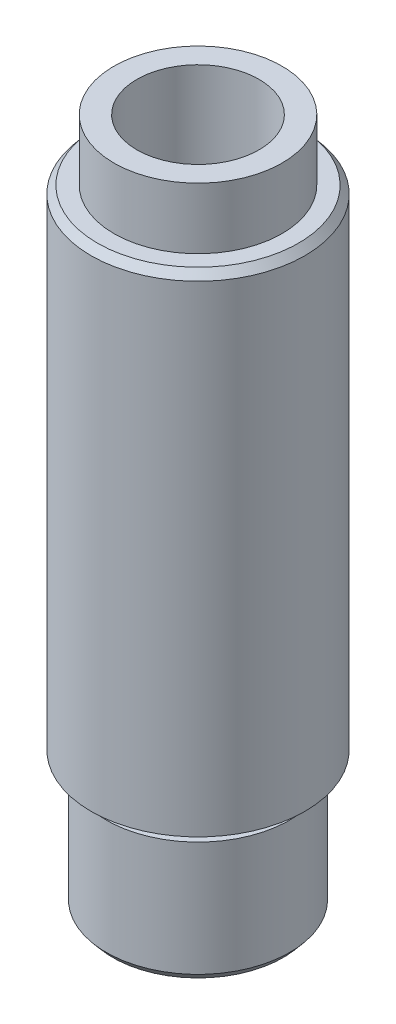
ISO-10303-21;
HEADER;
FILE_DESCRIPTION(('STEP AP214'),'2;1');
FILE_NAME('part.step','',(''),(''),'','','');
FILE_SCHEMA(('AUTOMOTIVE_DESIGN { 1 0 10303 214 1 1 1 1 }'));
ENDSEC;
DATA;
#1=APPLICATION_CONTEXT('core data for automotive mechanical design processes');
#2=APPLICATION_PROTOCOL_DEFINITION('international standard','automotive_design',2000,#1);
#3=PRODUCT_CONTEXT('',#1,'mechanical');
#4=PRODUCT('Part','Part','',(#3));
#5=PRODUCT_RELATED_PRODUCT_CATEGORY('part','',(#4));
#6=PRODUCT_DEFINITION_FORMATION('','',#4);
#7=PRODUCT_DEFINITION_CONTEXT('part definition',#1,'design');
#8=PRODUCT_DEFINITION('design','',#6,#7);
#9=PRODUCT_DEFINITION_SHAPE('','',#8);
#10=(LENGTH_UNIT() NAMED_UNIT(*) SI_UNIT(.MILLI.,.METRE.));
#11=(NAMED_UNIT(*) PLANE_ANGLE_UNIT() SI_UNIT($,.RADIAN.));
#12=(NAMED_UNIT(*) SI_UNIT($,.STERADIAN.) SOLID_ANGLE_UNIT());
#13=UNCERTAINTY_MEASURE_WITH_UNIT(LENGTH_MEASURE(1.E-05),#10,'distance_accuracy_value','');
#14=(GEOMETRIC_REPRESENTATION_CONTEXT(3) GLOBAL_UNCERTAINTY_ASSIGNED_CONTEXT((#13)) GLOBAL_UNIT_ASSIGNED_CONTEXT((#10,
#11,#12)) REPRESENTATION_CONTEXT('',''));
#15=CARTESIAN_POINT('',(0.,0.,0.));
#16=DIRECTION('',(0.,0.,1.));
#17=DIRECTION('',(1.,0.,0.));
#18=AXIS2_PLACEMENT_3D('',#15,#16,#17);
#19=CARTESIAN_POINT('',(0.,32.,0.));
#20=DIRECTION('',(0.,1.,0.));
#21=DIRECTION('',(0.,0.,1.));
#22=AXIS2_PLACEMENT_3D('',#19,#20,#21);
#23=PLANE('',#22);
#24=CARTESIAN_POINT('',(0.,32.,0.));
#25=DIRECTION('',(0.,1.,0.));
#26=DIRECTION('',(0.,0.,1.));
#27=AXIS2_PLACEMENT_3D('',#24,#25,#26);
#28=CIRCLE('',#27,6.58045018441136);
#29=CARTESIAN_POINT('',(0.,32.,6.58045018441136));
#30=VERTEX_POINT('',#29);
#31=EDGE_CURVE('E52',#30,#30,#28,.T.);
#32=ORIENTED_EDGE('',*,*,#31,.T.);
#33=EDGE_LOOP('',(#32));
#34=FACE_BOUND('',#33,.T.);
#35=CARTESIAN_POINT('',(0.,32.,0.));
#36=DIRECTION('',(0.,1.,0.));
#37=DIRECTION('',(0.,0.,1.));
#38=AXIS2_PLACEMENT_3D('',#35,#36,#37);
#39=CIRCLE('',#38,5.5);
#40=CARTESIAN_POINT('',(0.,32.,5.5));
#41=VERTEX_POINT('',#40);
#42=EDGE_CURVE('E90',#41,#41,#39,.T.);
#43=ORIENTED_EDGE('',*,*,#42,.F.);
#44=EDGE_LOOP('',(#43));
#45=FACE_BOUND('',#44,.T.);
#46=ADVANCED_FACE('F45',(#34,#45),#23,.T.);
#47=CARTESIAN_POINT('',(0.,0.,0.));
#48=DIRECTION('',(0.,1.,0.));
#49=DIRECTION('',(0.,0.,1.));
#50=AXIS2_PLACEMENT_3D('',#47,#48,#49);
#51=PLANE('',#50);
#52=CARTESIAN_POINT('',(0.,0.,0.));
#53=DIRECTION('',(0.,1.,0.));
#54=DIRECTION('',(0.,0.,1.));
#55=AXIS2_PLACEMENT_3D('',#52,#53,#54);
#56=CIRCLE('',#55,5.5);
#57=CARTESIAN_POINT('',(0.,0.,5.5));
#58=VERTEX_POINT('',#57);
#59=EDGE_CURVE('E71',#58,#58,#56,.F.);
#60=ORIENTED_EDGE('',*,*,#59,.F.);
#61=EDGE_LOOP('',(#60));
#62=FACE_BOUND('',#61,.T.);
#63=CARTESIAN_POINT('',(0.,0.,0.));
#64=DIRECTION('',(0.,1.,0.));
#65=DIRECTION('',(0.,0.,1.));
#66=AXIS2_PLACEMENT_3D('',#63,#64,#65);
#67=CIRCLE('',#66,7.);
#68=CARTESIAN_POINT('',(0.,0.,7.));
#69=VERTEX_POINT('',#68);
#70=EDGE_CURVE('E77',#69,#69,#67,.T.);
#71=ORIENTED_EDGE('',*,*,#70,.F.);
#72=EDGE_LOOP('',(#71));
#73=FACE_BOUND('',#72,.T.);
#74=ADVANCED_FACE('F115',(#62,#73),#51,.F.);
#75=CARTESIAN_POINT('',(0.,32.,0.));
#76=DIRECTION('',(0.,-1.,0.));
#77=DIRECTION('',(0.,0.,-1.));
#78=AXIS2_PLACEMENT_3D('',#75,#76,#77);
#79=CYLINDRICAL_SURFACE('',#78,7.);
#80=CARTESIAN_POINT('',(0.,31.5,0.));
#81=DIRECTION('',(0.,1.,0.));
#82=DIRECTION('',(0.,0.,1.));
#83=AXIS2_PLACEMENT_3D('',#80,#81,#82);
#84=CIRCLE('',#83,7.);
#85=CARTESIAN_POINT('',(0.,31.5,7.));
#86=VERTEX_POINT('',#85);
#87=EDGE_CURVE('E12',#86,#86,#84,.F.);
#88=ORIENTED_EDGE('',*,*,#87,.T.);
#89=EDGE_LOOP('',(#88));
#90=FACE_BOUND('',#89,.T.);
#91=ORIENTED_EDGE('',*,*,#70,.T.);
#92=EDGE_LOOP('',(#91));
#93=FACE_BOUND('',#92,.T.);
#94=ADVANCED_FACE('F120',(#90,#93),#79,.T.);
#95=CARTESIAN_POINT('',(0.,32.,0.));
#96=DIRECTION('',(0.,-1.,0.));
#97=DIRECTION('',(0.,0.,-1.));
#98=AXIS2_PLACEMENT_3D('',#95,#96,#97);
#99=CYLINDRICAL_SURFACE('',#98,4.);
#100=CARTESIAN_POINT('',(0.,3.,0.));
#101=DIRECTION('',(0.,1.,0.));
#102=DIRECTION('',(0.,0.,1.));
#103=AXIS2_PLACEMENT_3D('',#100,#101,#102);
#104=CIRCLE('',#103,4.);
#105=CARTESIAN_POINT('',(0.,3.,4.));
#106=VERTEX_POINT('',#105);
#107=EDGE_CURVE('E74',#106,#106,#104,.T.);
#108=ORIENTED_EDGE('',*,*,#107,.F.);
#109=EDGE_LOOP('',(#108));
#110=FACE_BOUND('',#109,.T.);
#111=CARTESIAN_POINT('',(0.,36.,0.));
#112=DIRECTION('',(0.,1.,0.));
#113=DIRECTION('',(0.,0.,1.));
#114=AXIS2_PLACEMENT_3D('',#111,#112,#113);
#115=CIRCLE('',#114,4.);
#116=CARTESIAN_POINT('',(0.,36.,4.));
#117=VERTEX_POINT('',#116);
#118=EDGE_CURVE('E93',#117,#117,#115,.T.);
#119=ORIENTED_EDGE('',*,*,#118,.T.);
#120=EDGE_LOOP('',(#119));
#121=FACE_BOUND('',#120,.T.);
#122=ADVANCED_FACE('F99',(#110,#121),#99,.F.);
#123=CARTESIAN_POINT('',(0.,3.,0.));
#124=DIRECTION('',(0.,1.,0.));
#125=DIRECTION('',(0.,0.,1.));
#126=AXIS2_PLACEMENT_3D('',#123,#124,#125);
#127=PLANE('',#126);
#128=CARTESIAN_POINT('',(0.,3.,0.));
#129=DIRECTION('',(0.,1.,0.));
#130=DIRECTION('',(0.,0.,1.));
#131=AXIS2_PLACEMENT_3D('',#128,#129,#130);
#132=CIRCLE('',#131,2.);
#133=CARTESIAN_POINT('',(0.,3.,2.));
#134=VERTEX_POINT('',#133);
#135=EDGE_CURVE('E86',#134,#134,#132,.T.);
#136=ORIENTED_EDGE('',*,*,#135,.F.);
#137=EDGE_LOOP('',(#136));
#138=FACE_BOUND('',#137,.T.);
#139=ORIENTED_EDGE('',*,*,#107,.T.);
#140=EDGE_LOOP('',(#139));
#141=FACE_BOUND('',#140,.T.);
#142=ADVANCED_FACE('F156',(#138,#141),#127,.T.);
#143=CARTESIAN_POINT('',(0.,-1.,0.));
#144=DIRECTION('',(0.,1.,0.));
#145=DIRECTION('',(0.,0.,1.));
#146=AXIS2_PLACEMENT_3D('',#143,#144,#145);
#147=CYLINDRICAL_SURFACE('',#146,5.5);
#148=CARTESIAN_POINT('',(0.,-1.,0.));
#149=DIRECTION('',(0.,-1.,0.));
#150=DIRECTION('',(0.,0.,-1.));
#151=AXIS2_PLACEMENT_3D('',#148,#149,#150);
#152=CIRCLE('',#151,5.5);
#153=CARTESIAN_POINT('',(0.,-1.,-5.5));
#154=VERTEX_POINT('',#153);
#155=EDGE_CURVE('E80',#154,#154,#152,.T.);
#156=ORIENTED_EDGE('',*,*,#155,.F.);
#157=EDGE_LOOP('',(#156));
#158=FACE_BOUND('',#157,.T.);
#159=ORIENTED_EDGE('',*,*,#59,.T.);
#160=EDGE_LOOP('',(#159));
#161=FACE_BOUND('',#160,.T.);
#162=ADVANCED_FACE('F159',(#158,#161),#147,.T.);
#163=CARTESIAN_POINT('',(0.,-9.,0.));
#164=DIRECTION('',(0.,1.,0.));
#165=DIRECTION('',(0.,0.,1.));
#166=AXIS2_PLACEMENT_3D('',#163,#164,#165);
#167=CYLINDRICAL_SURFACE('',#166,6.);
#168=CARTESIAN_POINT('',(0.,-8.5,0.));
#169=DIRECTION('',(0.,-1.,0.));
#170=DIRECTION('',(0.,0.,-1.));
#171=AXIS2_PLACEMENT_3D('',#168,#169,#170);
#172=CIRCLE('',#171,6.);
#173=CARTESIAN_POINT('',(0.,-8.5,-6.));
#174=VERTEX_POINT('',#173);
#175=EDGE_CURVE('E56',#174,#174,#172,.F.);
#176=ORIENTED_EDGE('',*,*,#175,.T.);
#177=EDGE_LOOP('',(#176));
#178=FACE_BOUND('',#177,.T.);
#179=CARTESIAN_POINT('',(0.,-1.,0.));
#180=DIRECTION('',(0.,-1.,0.));
#181=DIRECTION('',(0.,0.,-1.));
#182=AXIS2_PLACEMENT_3D('',#179,#180,#181);
#183=CIRCLE('',#182,6.);
#184=CARTESIAN_POINT('',(0.,-1.,-6.));
#185=VERTEX_POINT('',#184);
#186=EDGE_CURVE('E83',#185,#185,#183,.T.);
#187=ORIENTED_EDGE('',*,*,#186,.T.);
#188=EDGE_LOOP('',(#187));
#189=FACE_BOUND('',#188,.T.);
#190=ADVANCED_FACE('F145',(#178,#189),#167,.T.);
#191=CARTESIAN_POINT('',(0.,-9.,0.));
#192=DIRECTION('',(0.,-1.,0.));
#193=DIRECTION('',(0.,0.,-1.));
#194=AXIS2_PLACEMENT_3D('',#191,#192,#193);
#195=PLANE('',#194);
#196=CARTESIAN_POINT('',(0.,-9.,0.));
#197=DIRECTION('',(0.,-1.,0.));
#198=DIRECTION('',(0.,0.,-1.));
#199=AXIS2_PLACEMENT_3D('',#196,#197,#198);
#200=CIRCLE('',#199,5.58045018441136);
#201=CARTESIAN_POINT('',(0.,-9.,-5.58045018441136));
#202=VERTEX_POINT('',#201);
#203=EDGE_CURVE('E60',#202,#202,#200,.T.);
#204=ORIENTED_EDGE('',*,*,#203,.T.);
#205=EDGE_LOOP('',(#204));
#206=FACE_BOUND('',#205,.T.);
#207=CARTESIAN_POINT('',(0.,-9.,0.));
#208=DIRECTION('',(0.,-1.,0.));
#209=DIRECTION('',(0.,0.,-1.));
#210=AXIS2_PLACEMENT_3D('',#207,#208,#209);
#211=CIRCLE('',#210,5.00000000000002);
#212=CARTESIAN_POINT('',(0.,-9.,-5.00000000000002));
#213=VERTEX_POINT('',#212);
#214=EDGE_CURVE('E65',#213,#213,#211,.F.);
#215=ORIENTED_EDGE('',*,*,#214,.T.);
#216=EDGE_LOOP('',(#215));
#217=FACE_BOUND('',#216,.T.);
#218=ADVANCED_FACE('F141',(#206,#217),#195,.T.);
#219=CARTESIAN_POINT('',(0.,-1.,0.));
#220=DIRECTION('',(0.,-1.,0.));
#221=DIRECTION('',(0.,0.,-1.));
#222=AXIS2_PLACEMENT_3D('',#219,#220,#221);
#223=PLANE('',#222);
#224=ORIENTED_EDGE('',*,*,#155,.T.);
#225=EDGE_LOOP('',(#224));
#226=FACE_BOUND('',#225,.T.);
#227=ORIENTED_EDGE('',*,*,#186,.F.);
#228=EDGE_LOOP('',(#227));
#229=FACE_BOUND('',#228,.T.);
#230=ADVANCED_FACE('F144',(#226,#229),#223,.F.);
#231=CARTESIAN_POINT('',(0.,25.,0.));
#232=DIRECTION('',(0.,-1.,0.));
#233=DIRECTION('',(0.,0.,-1.));
#234=AXIS2_PLACEMENT_3D('',#231,#232,#233);
#235=CYLINDRICAL_SURFACE('',#234,2.);
#236=CARTESIAN_POINT('',(0.,-6.89937738537087,0.));
#237=DIRECTION('',(0.,-1.,0.));
#238=DIRECTION('',(0.,0.,-1.));
#239=AXIS2_PLACEMENT_3D('',#236,#237,#238);
#240=CIRCLE('',#239,2.);
#241=CARTESIAN_POINT('',(0.,-6.89937738537087,-2.));
#242=VERTEX_POINT('',#241);
#243=EDGE_CURVE('E68',#242,#242,#240,.T.);
#244=ORIENTED_EDGE('',*,*,#243,.T.);
#245=EDGE_LOOP('',(#244));
#246=FACE_BOUND('',#245,.T.);
#247=ORIENTED_EDGE('',*,*,#135,.T.);
#248=EDGE_LOOP('',(#247));
#249=FACE_BOUND('',#248,.T.);
#250=ADVANCED_FACE('F131',(#246,#249),#235,.F.);
#251=CARTESIAN_POINT('',(0.,-6.89937738537087,0.));
#252=DIRECTION('',(0.,-1.,0.));
#253=DIRECTION('',(0.,0.,-1.));
#254=AXIS2_PLACEMENT_3D('',#251,#252,#253);
#255=CONICAL_SURFACE('',#254,2.,0.959931088596884);
#256=ORIENTED_EDGE('',*,*,#214,.F.);
#257=EDGE_LOOP('',(#256));
#258=FACE_BOUND('',#257,.T.);
#259=ORIENTED_EDGE('',*,*,#243,.F.);
#260=EDGE_LOOP('',(#259));
#261=FACE_BOUND('',#260,.T.);
#262=ADVANCED_FACE('F129',(#258,#261),#255,.F.);
#263=CARTESIAN_POINT('',(0.,-9.,0.));
#264=DIRECTION('',(0.,1.,0.));
#265=DIRECTION('',(0.,0.,1.));
#266=AXIS2_PLACEMENT_3D('',#263,#264,#265);
#267=CONICAL_SURFACE('',#266,5.58045018441136,0.698131700797734);
#268=ORIENTED_EDGE('',*,*,#175,.F.);
#269=EDGE_LOOP('',(#268));
#270=FACE_BOUND('',#269,.T.);
#271=ORIENTED_EDGE('',*,*,#203,.F.);
#272=EDGE_LOOP('',(#271));
#273=FACE_BOUND('',#272,.T.);
#274=ADVANCED_FACE('F112',(#270,#273),#267,.T.);
#275=CARTESIAN_POINT('',(0.,32.,0.));
#276=DIRECTION('',(0.,-1.,0.));
#277=DIRECTION('',(0.,0.,-1.));
#278=AXIS2_PLACEMENT_3D('',#275,#276,#277);
#279=CONICAL_SURFACE('',#278,6.58045018441136,0.698131700797734);
#280=ORIENTED_EDGE('',*,*,#87,.F.);
#281=EDGE_LOOP('',(#280));
#282=FACE_BOUND('',#281,.T.);
#283=ORIENTED_EDGE('',*,*,#31,.F.);
#284=EDGE_LOOP('',(#283));
#285=FACE_BOUND('',#284,.T.);
#286=ADVANCED_FACE('F47',(#282,#285),#279,.T.);
#287=CARTESIAN_POINT('',(0.,36.,0.));
#288=DIRECTION('',(0.,1.,0.));
#289=DIRECTION('',(0.,0.,1.));
#290=AXIS2_PLACEMENT_3D('',#287,#288,#289);
#291=PLANE('',#290);
#292=CARTESIAN_POINT('',(0.,36.,0.));
#293=DIRECTION('',(0.,1.,0.));
#294=DIRECTION('',(0.,0.,1.));
#295=AXIS2_PLACEMENT_3D('',#292,#293,#294);
#296=CIRCLE('',#295,5.5);
#297=CARTESIAN_POINT('',(0.,36.,5.5));
#298=VERTEX_POINT('',#297);
#299=EDGE_CURVE('E89',#298,#298,#296,.T.);
#300=ORIENTED_EDGE('',*,*,#299,.T.);
#301=EDGE_LOOP('',(#300));
#302=FACE_BOUND('',#301,.T.);
#303=ORIENTED_EDGE('',*,*,#118,.F.);
#304=EDGE_LOOP('',(#303));
#305=FACE_BOUND('',#304,.T.);
#306=ADVANCED_FACE('F101',(#302,#305),#291,.T.);
#307=CARTESIAN_POINT('',(0.,36.,0.));
#308=DIRECTION('',(0.,-1.,0.));
#309=DIRECTION('',(0.,0.,-1.));
#310=AXIS2_PLACEMENT_3D('',#307,#308,#309);
#311=CYLINDRICAL_SURFACE('',#310,5.5);
#312=ORIENTED_EDGE('',*,*,#299,.F.);
#313=EDGE_LOOP('',(#312));
#314=FACE_BOUND('',#313,.T.);
#315=ORIENTED_EDGE('',*,*,#42,.T.);
#316=EDGE_LOOP('',(#315));
#317=FACE_BOUND('',#316,.T.);
#318=ADVANCED_FACE('F103',(#314,#317),#311,.T.);
#319=CLOSED_SHELL('',(#46,#74,#94,#122,#142,#162,#190,#218,#230,#250,#262,#274,#286,#306,#318));
#320=MANIFOLD_SOLID_BREP('B2',#319);
#321=ADVANCED_BREP_SHAPE_REPRESENTATION('',(#18,#320),#14);
#322=SHAPE_DEFINITION_REPRESENTATION(#9,#321);
ENDSEC;
END-ISO-10303-21;
